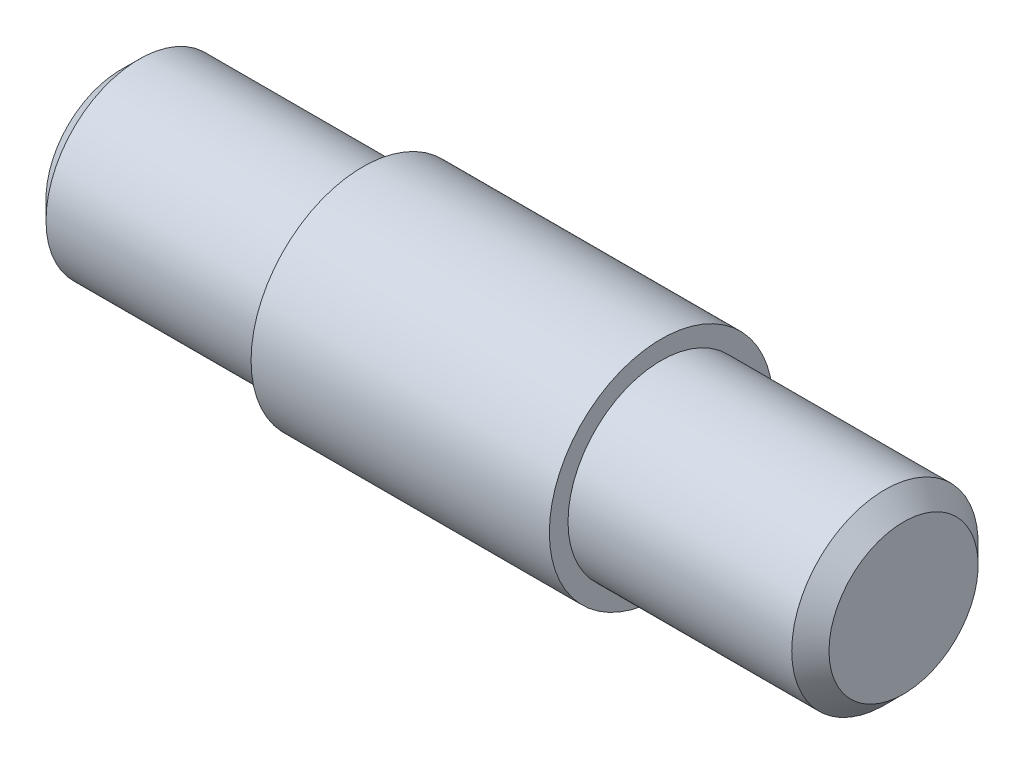
ISO-10303-21;
HEADER;
FILE_DESCRIPTION(('STEP AP214'),'2;1');
FILE_NAME('part.step','',(''),(''),'','','');
FILE_SCHEMA(('AUTOMOTIVE_DESIGN { 1 0 10303 214 1 1 1 1 }'));
ENDSEC;
DATA;
#1=APPLICATION_CONTEXT('core data for automotive mechanical design processes');
#2=APPLICATION_PROTOCOL_DEFINITION('international standard','automotive_design',2000,#1);
#3=PRODUCT_CONTEXT('',#1,'mechanical');
#4=PRODUCT('Part','Part','',(#3));
#5=PRODUCT_RELATED_PRODUCT_CATEGORY('part','',(#4));
#6=PRODUCT_DEFINITION_FORMATION('','',#4);
#7=PRODUCT_DEFINITION_CONTEXT('part definition',#1,'design');
#8=PRODUCT_DEFINITION('design','',#6,#7);
#9=PRODUCT_DEFINITION_SHAPE('','',#8);
#10=(LENGTH_UNIT() NAMED_UNIT(*) SI_UNIT(.MILLI.,.METRE.));
#11=(NAMED_UNIT(*) PLANE_ANGLE_UNIT() SI_UNIT($,.RADIAN.));
#12=(NAMED_UNIT(*) SI_UNIT($,.STERADIAN.) SOLID_ANGLE_UNIT());
#13=UNCERTAINTY_MEASURE_WITH_UNIT(LENGTH_MEASURE(1.E-05),#10,'distance_accuracy_value','');
#14=(GEOMETRIC_REPRESENTATION_CONTEXT(3) GLOBAL_UNCERTAINTY_ASSIGNED_CONTEXT((#13)) GLOBAL_UNIT_ASSIGNED_CONTEXT((#10,
#11,#12)) REPRESENTATION_CONTEXT('',''));
#15=CARTESIAN_POINT('',(0.,0.,0.));
#16=DIRECTION('',(0.,0.,1.));
#17=DIRECTION('',(1.,0.,0.));
#18=AXIS2_PLACEMENT_3D('',#15,#16,#17);
#19=CARTESIAN_POINT('',(0.,0.,0.));
#20=DIRECTION('',(1.,0.,0.));
#21=DIRECTION('',(0.,0.,-1.));
#22=AXIS2_PLACEMENT_3D('',#19,#20,#21);
#23=PLANE('',#22);
#24=CARTESIAN_POINT('',(0.,0.,0.));
#25=DIRECTION('',(1.,0.,0.));
#26=DIRECTION('',(0.,0.,-1.));
#27=AXIS2_PLACEMENT_3D('',#24,#25,#26);
#28=CIRCLE('',#27,2.);
#29=CARTESIAN_POINT('',(0.,0.,-2.));
#30=VERTEX_POINT('',#29);
#31=EDGE_CURVE('E44',#30,#30,#28,.F.);
#32=ORIENTED_EDGE('',*,*,#31,.T.);
#33=EDGE_LOOP('',(#32));
#34=FACE_BOUND('',#33,.T.);
#35=ADVANCED_FACE('F37',(#34),#23,.F.);
#36=CARTESIAN_POINT('',(-54.8246366619784,0.,0.));
#37=DIRECTION('',(-1.,0.,0.));
#38=DIRECTION('',(0.,0.,1.));
#39=AXIS2_PLACEMENT_3D('',#36,#37,#38);
#40=CYLINDRICAL_SURFACE('',#39,2.5);
#41=CARTESIAN_POINT('',(0.499999999999994,0.,0.));
#42=DIRECTION('',(1.,0.,0.));
#43=DIRECTION('',(0.,0.,-1.));
#44=AXIS2_PLACEMENT_3D('',#41,#42,#43);
#45=CIRCLE('',#44,2.5);
#46=CARTESIAN_POINT('',(0.499999999999994,0.,-2.5));
#47=VERTEX_POINT('',#46);
#48=EDGE_CURVE('E10',#47,#47,#45,.T.);
#49=ORIENTED_EDGE('',*,*,#48,.T.);
#50=EDGE_LOOP('',(#49));
#51=FACE_BOUND('',#50,.T.);
#52=CARTESIAN_POINT('',(6.5,0.,0.));
#53=DIRECTION('',(-1.,0.,0.));
#54=DIRECTION('',(0.,0.,1.));
#55=AXIS2_PLACEMENT_3D('',#52,#53,#54);
#56=CIRCLE('',#55,2.5);
#57=CARTESIAN_POINT('',(6.5,0.,2.5));
#58=VERTEX_POINT('',#57);
#59=EDGE_CURVE('E57',#58,#58,#56,.T.);
#60=ORIENTED_EDGE('',*,*,#59,.T.);
#61=EDGE_LOOP('',(#60));
#62=FACE_BOUND('',#61,.T.);
#63=ADVANCED_FACE('F88',(#51,#62),#40,.T.);
#64=CARTESIAN_POINT('',(6.5,2.5,0.));
#65=DIRECTION('',(1.,0.,0.));
#66=DIRECTION('',(0.,0.,-1.));
#67=AXIS2_PLACEMENT_3D('',#64,#65,#66);
#68=PLANE('',#67);
#69=ORIENTED_EDGE('',*,*,#59,.F.);
#70=EDGE_LOOP('',(#69));
#71=FACE_BOUND('',#70,.T.);
#72=CARTESIAN_POINT('',(6.5,0.,0.));
#73=DIRECTION('',(-1.,0.,0.));
#74=DIRECTION('',(0.,0.,1.));
#75=AXIS2_PLACEMENT_3D('',#72,#73,#74);
#76=CIRCLE('',#75,3.);
#77=CARTESIAN_POINT('',(6.5,0.,3.));
#78=VERTEX_POINT('',#77);
#79=EDGE_CURVE('E60',#78,#78,#76,.T.);
#80=ORIENTED_EDGE('',*,*,#79,.T.);
#81=EDGE_LOOP('',(#80));
#82=FACE_BOUND('',#81,.T.);
#83=ADVANCED_FACE('F93',(#71,#82),#68,.F.);
#84=CARTESIAN_POINT('',(-54.8246366619784,0.,0.));
#85=DIRECTION('',(-1.,0.,0.));
#86=DIRECTION('',(0.,0.,1.));
#87=AXIS2_PLACEMENT_3D('',#84,#85,#86);
#88=CYLINDRICAL_SURFACE('',#87,3.);
#89=ORIENTED_EDGE('',*,*,#79,.F.);
#90=EDGE_LOOP('',(#89));
#91=FACE_BOUND('',#90,.T.);
#92=CARTESIAN_POINT('',(14.5,0.,0.));
#93=DIRECTION('',(-1.,0.,0.));
#94=DIRECTION('',(0.,0.,1.));
#95=AXIS2_PLACEMENT_3D('',#92,#93,#94);
#96=CIRCLE('',#95,3.);
#97=CARTESIAN_POINT('',(14.5,0.,3.));
#98=VERTEX_POINT('',#97);
#99=EDGE_CURVE('E63',#98,#98,#96,.T.);
#100=ORIENTED_EDGE('',*,*,#99,.T.);
#101=EDGE_LOOP('',(#100));
#102=FACE_BOUND('',#101,.T.);
#103=ADVANCED_FACE('F84',(#91,#102),#88,.T.);
#104=CARTESIAN_POINT('',(14.5,3.,0.));
#105=DIRECTION('',(-1.,0.,0.));
#106=DIRECTION('',(0.,0.,1.));
#107=AXIS2_PLACEMENT_3D('',#104,#105,#106);
#108=PLANE('',#107);
#109=ORIENTED_EDGE('',*,*,#99,.F.);
#110=EDGE_LOOP('',(#109));
#111=FACE_BOUND('',#110,.T.);
#112=CARTESIAN_POINT('',(14.5,0.,0.));
#113=DIRECTION('',(-1.,0.,0.));
#114=DIRECTION('',(0.,0.,1.));
#115=AXIS2_PLACEMENT_3D('',#112,#113,#114);
#116=CIRCLE('',#115,2.5);
#117=CARTESIAN_POINT('',(14.5,0.,2.5));
#118=VERTEX_POINT('',#117);
#119=EDGE_CURVE('E66',#118,#118,#116,.T.);
#120=ORIENTED_EDGE('',*,*,#119,.T.);
#121=EDGE_LOOP('',(#120));
#122=FACE_BOUND('',#121,.T.);
#123=ADVANCED_FACE('F70',(#111,#122),#108,.F.);
#124=CARTESIAN_POINT('',(-54.8246366619784,0.,0.));
#125=DIRECTION('',(-1.,0.,0.));
#126=DIRECTION('',(0.,0.,1.));
#127=AXIS2_PLACEMENT_3D('',#124,#125,#126);
#128=CYLINDRICAL_SURFACE('',#127,2.5);
#129=CARTESIAN_POINT('',(20.5,0.,0.));
#130=DIRECTION('',(-1.,0.,0.));
#131=DIRECTION('',(0.,0.,1.));
#132=AXIS2_PLACEMENT_3D('',#129,#130,#131);
#133=CIRCLE('',#132,2.5);
#134=CARTESIAN_POINT('',(20.5,0.,2.5));
#135=VERTEX_POINT('',#134);
#136=EDGE_CURVE('E52',#135,#135,#133,.T.);
#137=ORIENTED_EDGE('',*,*,#136,.T.);
#138=EDGE_LOOP('',(#137));
#139=FACE_BOUND('',#138,.T.);
#140=ORIENTED_EDGE('',*,*,#119,.F.);
#141=EDGE_LOOP('',(#140));
#142=FACE_BOUND('',#141,.T.);
#143=ADVANCED_FACE('F72',(#139,#142),#128,.T.);
#144=CARTESIAN_POINT('',(21.,2.5,0.));
#145=DIRECTION('',(-1.,0.,0.));
#146=DIRECTION('',(0.,0.,1.));
#147=AXIS2_PLACEMENT_3D('',#144,#145,#146);
#148=PLANE('',#147);
#149=CARTESIAN_POINT('',(21.,0.,0.));
#150=DIRECTION('',(-1.,0.,0.));
#151=DIRECTION('',(0.,0.,1.));
#152=AXIS2_PLACEMENT_3D('',#149,#150,#151);
#153=CIRCLE('',#152,1.99999999999999);
#154=CARTESIAN_POINT('',(21.,0.,1.99999999999999));
#155=VERTEX_POINT('',#154);
#156=EDGE_CURVE('E48',#155,#155,#153,.F.);
#157=ORIENTED_EDGE('',*,*,#156,.T.);
#158=EDGE_LOOP('',(#157));
#159=FACE_BOUND('',#158,.T.);
#160=ADVANCED_FACE('F74',(#159),#148,.F.);
#161=CARTESIAN_POINT('',(20.5,0.,0.));
#162=DIRECTION('',(-1.,0.,0.));
#163=DIRECTION('',(0.,0.,1.));
#164=AXIS2_PLACEMENT_3D('',#161,#162,#163);
#165=CONICAL_SURFACE('',#164,2.5,0.785398163397463);
#166=ORIENTED_EDGE('',*,*,#156,.F.);
#167=EDGE_LOOP('',(#166));
#168=FACE_BOUND('',#167,.T.);
#169=ORIENTED_EDGE('',*,*,#136,.F.);
#170=EDGE_LOOP('',(#169));
#171=FACE_BOUND('',#170,.T.);
#172=ADVANCED_FACE('F81',(#168,#171),#165,.T.);
#173=CARTESIAN_POINT('',(0.,0.,0.));
#174=DIRECTION('',(1.,0.,0.));
#175=DIRECTION('',(0.,0.,-1.));
#176=AXIS2_PLACEMENT_3D('',#173,#174,#175);
#177=CONICAL_SURFACE('',#176,2.,0.78539816339745);
#178=ORIENTED_EDGE('',*,*,#48,.F.);
#179=EDGE_LOOP('',(#178));
#180=FACE_BOUND('',#179,.T.);
#181=ORIENTED_EDGE('',*,*,#31,.F.);
#182=EDGE_LOOP('',(#181));
#183=FACE_BOUND('',#182,.T.);
#184=ADVANCED_FACE('F39',(#180,#183),#177,.T.);
#185=CLOSED_SHELL('',(#35,#63,#83,#103,#123,#143,#160,#172,#184));
#186=MANIFOLD_SOLID_BREP('B2',#185);
#187=ADVANCED_BREP_SHAPE_REPRESENTATION('',(#18,#186),#14);
#188=SHAPE_DEFINITION_REPRESENTATION(#9,#187);
ENDSEC;
END-ISO-10303-21;
